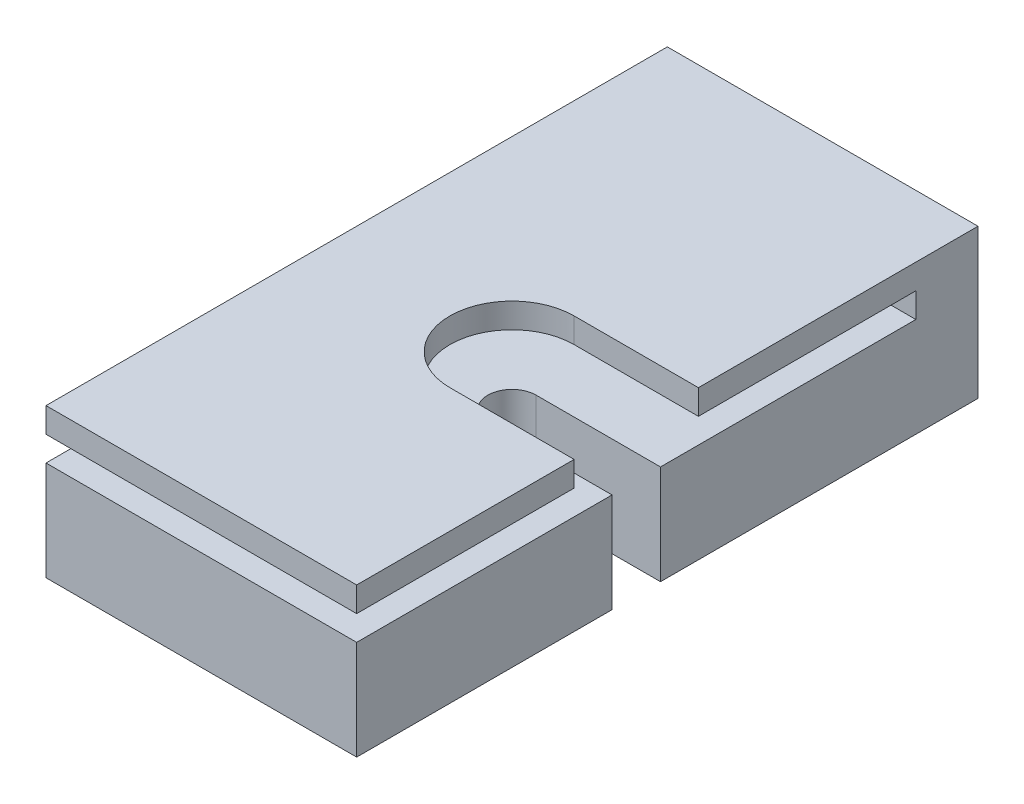
ISO-10303-21;
HEADER;
FILE_DESCRIPTION(('STEP AP214'),'2;1');
FILE_NAME('part.step','',(''),(''),'','','');
FILE_SCHEMA(('AUTOMOTIVE_DESIGN { 1 0 10303 214 1 1 1 1 }'));
ENDSEC;
DATA;
#1=APPLICATION_CONTEXT('core data for automotive mechanical design processes');
#2=APPLICATION_PROTOCOL_DEFINITION('international standard','automotive_design',2000,#1);
#3=PRODUCT_CONTEXT('',#1,'mechanical');
#4=PRODUCT('Part','Part','',(#3));
#5=PRODUCT_RELATED_PRODUCT_CATEGORY('part','',(#4));
#6=PRODUCT_DEFINITION_FORMATION('','',#4);
#7=PRODUCT_DEFINITION_CONTEXT('part definition',#1,'design');
#8=PRODUCT_DEFINITION('design','',#6,#7);
#9=PRODUCT_DEFINITION_SHAPE('','',#8);
#10=(LENGTH_UNIT() NAMED_UNIT(*) SI_UNIT(.MILLI.,.METRE.));
#11=(NAMED_UNIT(*) PLANE_ANGLE_UNIT() SI_UNIT($,.RADIAN.));
#12=(NAMED_UNIT(*) SI_UNIT($,.STERADIAN.) SOLID_ANGLE_UNIT());
#13=UNCERTAINTY_MEASURE_WITH_UNIT(LENGTH_MEASURE(1.E-05),#10,'distance_accuracy_value','');
#14=(GEOMETRIC_REPRESENTATION_CONTEXT(3) GLOBAL_UNCERTAINTY_ASSIGNED_CONTEXT((#13)) GLOBAL_UNIT_ASSIGNED_CONTEXT((#10,
#11,#12)) REPRESENTATION_CONTEXT('',''));
#15=CARTESIAN_POINT('',(0.,0.,0.));
#16=DIRECTION('',(0.,0.,1.));
#17=DIRECTION('',(1.,0.,0.));
#18=AXIS2_PLACEMENT_3D('',#15,#16,#17);
#19=CARTESIAN_POINT('',(-38.284177628754,8.14590879240231,50.));
#20=DIRECTION('',(-1.,0.,0.));
#21=DIRECTION('',(0.,0.,1.));
#22=AXIS2_PLACEMENT_3D('',#19,#20,#21);
#23=PLANE('',#22);
#24=DIRECTION('',(0.,0.,-1.));
#25=VECTOR('',#24,1.);
#26=CARTESIAN_POINT('',(-38.284177628754,-3.85409120759769,50.));
#27=LINE('',#26,#25);
#28=CARTESIAN_POINT('',(-38.284177628754,-3.85409120759769,50.));
#29=VERTEX_POINT('',#28);
#30=CARTESIAN_POINT('',(-38.284177628754,-3.85409120759769,29.45));
#31=VERTEX_POINT('',#30);
#32=EDGE_CURVE('E45',#29,#31,#27,.T.);
#33=ORIENTED_EDGE('',*,*,#32,.T.);
#34=DIRECTION('',(0.,1.,0.));
#35=VECTOR('',#34,1.);
#36=CARTESIAN_POINT('',(-38.284177628754,-16.4243935110429,29.45));
#37=LINE('',#36,#35);
#38=CARTESIAN_POINT('',(-38.284177628754,4.14590879240231,29.45));
#39=VERTEX_POINT('',#38);
#40=EDGE_CURVE('E177',#31,#39,#37,.T.);
#41=ORIENTED_EDGE('',*,*,#40,.T.);
#42=DIRECTION('',(0.,0.,1.));
#43=VECTOR('',#42,1.);
#44=CARTESIAN_POINT('',(-38.284177628754,4.14590879240231,5.));
#45=LINE('',#44,#43);
#46=CARTESIAN_POINT('',(-38.284177628754,4.14590879240231,50.));
#47=VERTEX_POINT('',#46);
#48=EDGE_CURVE('E258',#39,#47,#45,.T.);
#49=ORIENTED_EDGE('',*,*,#48,.T.);
#50=DIRECTION('',(0.,1.,0.));
#51=VECTOR('',#50,1.);
#52=CARTESIAN_POINT('',(-38.284177628754,8.14590879240231,50.));
#53=LINE('',#52,#51);
#54=EDGE_CURVE('E267',#29,#47,#53,.T.);
#55=ORIENTED_EDGE('',*,*,#54,.F.);
#56=EDGE_LOOP('',(#33,#41,#49,#55));
#57=FACE_BOUND('',#56,.T.);
#58=ADVANCED_FACE('F36',(#57),#23,.F.);
#59=DIRECTION('',(0.,-1.,0.));
#60=VECTOR('',#59,1.);
#61=CARTESIAN_POINT('',(-38.284177628754,26.1736651697223,32.5));
#62=LINE('',#61,#60);
#63=CARTESIAN_POINT('',(-38.284177628754,8.14590879240231,32.5));
#64=VERTEX_POINT('',#63);
#65=CARTESIAN_POINT('',(-38.284177628754,6.14590879240231,32.5));
#66=VERTEX_POINT('',#65);
#67=EDGE_CURVE('E206',#64,#66,#62,.T.);
#68=ORIENTED_EDGE('',*,*,#67,.F.);
#69=DIRECTION('',(0.,0.,-1.));
#70=VECTOR('',#69,1.);
#71=CARTESIAN_POINT('',(-38.284177628754,8.14590879240231,50.));
#72=LINE('',#71,#70);
#73=CARTESIAN_POINT('',(-38.284177628754,8.14590879240231,50.));
#74=VERTEX_POINT('',#73);
#75=EDGE_CURVE('E286',#74,#64,#72,.T.);
#76=ORIENTED_EDGE('',*,*,#75,.F.);
#77=CARTESIAN_POINT('',(-38.284177628754,6.14590879240231,50.));
#78=VERTEX_POINT('',#77);
#79=EDGE_CURVE('E266',#78,#74,#53,.T.);
#80=ORIENTED_EDGE('',*,*,#79,.F.);
#81=DIRECTION('',(0.,0.,1.));
#82=VECTOR('',#81,1.);
#83=CARTESIAN_POINT('',(-38.284177628754,6.14590879240231,5.));
#84=LINE('',#83,#82);
#85=EDGE_CURVE('E255',#66,#78,#84,.T.);
#86=ORIENTED_EDGE('',*,*,#85,.F.);
#87=EDGE_LOOP('',(#68,#76,#80,#86));
#88=FACE_BOUND('',#87,.T.);
#89=ADVANCED_FACE('F350',(#88),#23,.F.);
#90=CARTESIAN_POINT('',(-63.284177628754,8.14590879240231,50.));
#91=DIRECTION('',(0.,-1.,0.));
#92=DIRECTION('',(0.,0.,-1.));
#93=AXIS2_PLACEMENT_3D('',#90,#91,#92);
#94=PLANE('',#93);
#95=DIRECTION('',(-1.,0.,0.));
#96=VECTOR('',#95,1.);
#97=CARTESIAN_POINT('',(0.,8.14590879240231,32.5));
#98=LINE('',#97,#96);
#99=CARTESIAN_POINT('',(-48.284177628754,8.14590879240231,32.5));
#100=VERTEX_POINT('',#99);
#101=EDGE_CURVE('E205',#64,#100,#98,.T.);
#102=ORIENTED_EDGE('',*,*,#101,.T.);
#103=CARTESIAN_POINT('',(-48.284177628754,8.14590879240231,27.5));
#104=DIRECTION('',(0.,-1.,0.));
#105=DIRECTION('',(0.,0.,-1.));
#106=AXIS2_PLACEMENT_3D('',#103,#104,#105);
#107=CIRCLE('',#106,5.);
#108=CARTESIAN_POINT('',(-48.284177628754,8.14590879240231,22.5));
#109=VERTEX_POINT('',#108);
#110=EDGE_CURVE('E209',#109,#100,#107,.F.);
#111=ORIENTED_EDGE('',*,*,#110,.F.);
#112=DIRECTION('',(-1.,0.,0.));
#113=VECTOR('',#112,1.);
#114=CARTESIAN_POINT('',(0.,8.14590879240231,22.5));
#115=LINE('',#114,#113);
#116=CARTESIAN_POINT('',(-38.284177628754,8.14590879240231,22.5));
#117=VERTEX_POINT('',#116);
#118=EDGE_CURVE('E203',#117,#109,#115,.T.);
#119=ORIENTED_EDGE('',*,*,#118,.F.);
#120=CARTESIAN_POINT('',(-38.284177628754,8.14590879240231,0.));
#121=VERTEX_POINT('',#120);
#122=EDGE_CURVE('E285',#117,#121,#72,.T.);
#123=ORIENTED_EDGE('',*,*,#122,.T.);
#124=DIRECTION('',(-1.,0.,0.));
#125=VECTOR('',#124,1.);
#126=CARTESIAN_POINT('',(-63.284177628754,8.14590879240231,0.));
#127=LINE('',#126,#125);
#128=CARTESIAN_POINT('',(-63.284177628754,8.14590879240231,0.));
#129=VERTEX_POINT('',#128);
#130=EDGE_CURVE('E281',#121,#129,#127,.T.);
#131=ORIENTED_EDGE('',*,*,#130,.T.);
#132=DIRECTION('',(0.,0.,-1.));
#133=VECTOR('',#132,1.);
#134=CARTESIAN_POINT('',(-63.284177628754,8.14590879240231,50.));
#135=LINE('',#134,#133);
#136=CARTESIAN_POINT('',(-63.284177628754,8.14590879240231,50.));
#137=VERTEX_POINT('',#136);
#138=EDGE_CURVE('E272',#137,#129,#135,.T.);
#139=ORIENTED_EDGE('',*,*,#138,.F.);
#140=DIRECTION('',(-1.,0.,0.));
#141=VECTOR('',#140,1.);
#142=CARTESIAN_POINT('',(-63.284177628754,8.14590879240231,50.));
#143=LINE('',#142,#141);
#144=EDGE_CURVE('E270',#74,#137,#143,.T.);
#145=ORIENTED_EDGE('',*,*,#144,.F.);
#146=ORIENTED_EDGE('',*,*,#75,.T.);
#147=EDGE_LOOP('',(#102,#111,#119,#123,#131,#139,#145,#146));
#148=FACE_BOUND('',#147,.T.);
#149=ADVANCED_FACE('F316',(#148),#94,.F.);
#150=CARTESIAN_POINT('',(-63.284177628754,6.14590879240231,5.));
#151=DIRECTION('',(0.,1.,0.));
#152=DIRECTION('',(0.,0.,1.));
#153=AXIS2_PLACEMENT_3D('',#150,#151,#152);
#154=PLANE('',#153);
#155=DIRECTION('',(1.,0.,0.));
#156=VECTOR('',#155,1.);
#157=CARTESIAN_POINT('',(0.,6.14590879240231,32.5));
#158=LINE('',#157,#156);
#159=CARTESIAN_POINT('',(-48.284177628754,6.14590879240231,32.5));
#160=VERTEX_POINT('',#159);
#161=EDGE_CURVE('E210',#160,#66,#158,.T.);
#162=ORIENTED_EDGE('',*,*,#161,.T.);
#163=ORIENTED_EDGE('',*,*,#85,.T.);
#164=DIRECTION('',(-1.,0.,0.));
#165=VECTOR('',#164,1.);
#166=CARTESIAN_POINT('',(-63.284177628754,6.14590879240231,50.));
#167=LINE('',#166,#165);
#168=CARTESIAN_POINT('',(-63.284177628754,6.14590879240231,50.));
#169=VERTEX_POINT('',#168);
#170=EDGE_CURVE('E236',#78,#169,#167,.T.);
#171=ORIENTED_EDGE('',*,*,#170,.T.);
#172=DIRECTION('',(0.,0.,1.));
#173=VECTOR('',#172,1.);
#174=CARTESIAN_POINT('',(-63.284177628754,6.14590879240231,5.));
#175=LINE('',#174,#173);
#176=CARTESIAN_POINT('',(-63.284177628754,6.14590879240231,5.));
#177=VERTEX_POINT('',#176);
#178=EDGE_CURVE('E248',#177,#169,#175,.T.);
#179=ORIENTED_EDGE('',*,*,#178,.F.);
#180=DIRECTION('',(-1.,0.,0.));
#181=VECTOR('',#180,1.);
#182=CARTESIAN_POINT('',(-63.284177628754,6.14590879240231,5.));
#183=LINE('',#182,#181);
#184=CARTESIAN_POINT('',(-38.284177628754,6.14590879240231,5.));
#185=VERTEX_POINT('',#184);
#186=EDGE_CURVE('E241',#185,#177,#183,.T.);
#187=ORIENTED_EDGE('',*,*,#186,.F.);
#188=CARTESIAN_POINT('',(-38.284177628754,6.14590879240231,22.5));
#189=VERTEX_POINT('',#188);
#190=EDGE_CURVE('E252',#185,#189,#84,.T.);
#191=ORIENTED_EDGE('',*,*,#190,.T.);
#192=DIRECTION('',(1.,0.,0.));
#193=VECTOR('',#192,1.);
#194=CARTESIAN_POINT('',(0.,6.14590879240231,22.5));
#195=LINE('',#194,#193);
#196=CARTESIAN_POINT('',(-48.284177628754,6.14590879240231,22.5));
#197=VERTEX_POINT('',#196);
#198=EDGE_CURVE('E214',#197,#189,#195,.T.);
#199=ORIENTED_EDGE('',*,*,#198,.F.);
#200=CARTESIAN_POINT('',(-48.284177628754,6.14590879240231,27.5));
#201=DIRECTION('',(0.,-1.,0.));
#202=DIRECTION('',(0.,0.,-1.));
#203=AXIS2_PLACEMENT_3D('',#200,#201,#202);
#204=CIRCLE('',#203,5.);
#205=EDGE_CURVE('E61',#160,#197,#204,.T.);
#206=ORIENTED_EDGE('',*,*,#205,.F.);
#207=EDGE_LOOP('',(#162,#163,#171,#179,#187,#191,#199,#206));
#208=FACE_BOUND('',#207,.T.);
#209=ADVANCED_FACE('F338',(#208),#154,.F.);
#210=CARTESIAN_POINT('',(0.,0.,50.));
#211=DIRECTION('',(0.,0.,1.));
#212=DIRECTION('',(1.,0.,0.));
#213=AXIS2_PLACEMENT_3D('',#210,#211,#212);
#214=PLANE('',#213);
#215=ORIENTED_EDGE('',*,*,#170,.F.);
#216=ORIENTED_EDGE('',*,*,#79,.T.);
#217=ORIENTED_EDGE('',*,*,#144,.T.);
#218=DIRECTION('',(0.,-1.,0.));
#219=VECTOR('',#218,1.);
#220=CARTESIAN_POINT('',(-63.284177628754,8.14590879240231,50.));
#221=LINE('',#220,#219);
#222=EDGE_CURVE('E260',#137,#169,#221,.T.);
#223=ORIENTED_EDGE('',*,*,#222,.T.);
#224=EDGE_LOOP('',(#215,#216,#217,#223));
#225=FACE_BOUND('',#224,.T.);
#226=ADVANCED_FACE('F353',(#225),#214,.T.);
#227=CARTESIAN_POINT('',(-63.284177628754,8.14590879240231,50.));
#228=DIRECTION('',(1.,0.,0.));
#229=DIRECTION('',(0.,0.,-1.));
#230=AXIS2_PLACEMENT_3D('',#227,#228,#229);
#231=PLANE('',#230);
#232=DIRECTION('',(0.,-1.,0.));
#233=VECTOR('',#232,1.);
#234=CARTESIAN_POINT('',(-63.284177628754,6.14590879240231,5.));
#235=LINE('',#234,#233);
#236=CARTESIAN_POINT('',(-63.284177628754,4.14590879240231,5.));
#237=VERTEX_POINT('',#236);
#238=EDGE_CURVE('E232',#177,#237,#235,.T.);
#239=ORIENTED_EDGE('',*,*,#238,.F.);
#240=ORIENTED_EDGE('',*,*,#178,.T.);
#241=ORIENTED_EDGE('',*,*,#222,.F.);
#242=ORIENTED_EDGE('',*,*,#138,.T.);
#243=DIRECTION('',(0.,-1.,0.));
#244=VECTOR('',#243,1.);
#245=CARTESIAN_POINT('',(-63.284177628754,8.14590879240231,0.));
#246=LINE('',#245,#244);
#247=CARTESIAN_POINT('',(-63.284177628754,-3.85409120759769,0.));
#248=VERTEX_POINT('',#247);
#249=EDGE_CURVE('E251',#129,#248,#246,.T.);
#250=ORIENTED_EDGE('',*,*,#249,.T.);
#251=DIRECTION('',(0.,0.,-1.));
#252=VECTOR('',#251,1.);
#253=CARTESIAN_POINT('',(-63.284177628754,-3.85409120759769,50.));
#254=LINE('',#253,#252);
#255=CARTESIAN_POINT('',(-63.284177628754,-3.85409120759769,50.));
#256=VERTEX_POINT('',#255);
#257=EDGE_CURVE('E11',#256,#248,#254,.T.);
#258=ORIENTED_EDGE('',*,*,#257,.F.);
#259=CARTESIAN_POINT('',(-63.284177628754,4.14590879240231,50.));
#260=VERTEX_POINT('',#259);
#261=EDGE_CURVE('E264',#260,#256,#221,.T.);
#262=ORIENTED_EDGE('',*,*,#261,.F.);
#263=DIRECTION('',(0.,0.,1.));
#264=VECTOR('',#263,1.);
#265=CARTESIAN_POINT('',(-63.284177628754,4.14590879240231,5.));
#266=LINE('',#265,#264);
#267=EDGE_CURVE('E244',#237,#260,#266,.T.);
#268=ORIENTED_EDGE('',*,*,#267,.F.);
#269=EDGE_LOOP('',(#239,#240,#241,#242,#250,#258,#262,#268));
#270=FACE_BOUND('',#269,.T.);
#271=ADVANCED_FACE('F38',(#270),#231,.F.);
#272=CARTESIAN_POINT('',(-63.284177628754,-3.85409120759769,50.));
#273=DIRECTION('',(0.,1.,0.));
#274=DIRECTION('',(0.,0.,1.));
#275=AXIS2_PLACEMENT_3D('',#272,#273,#274);
#276=PLANE('',#275);
#277=CARTESIAN_POINT('',(-56.284177628754,-3.85409120759769,9.99999999999999));
#278=DIRECTION('',(0.,1.,0.));
#279=DIRECTION('',(0.,0.,1.));
#280=AXIS2_PLACEMENT_3D('',#277,#278,#279);
#281=CIRCLE('',#280,1.5);
#282=CARTESIAN_POINT('',(-56.284177628754,-3.85409120759769,11.5));
#283=VERTEX_POINT('',#282);
#284=EDGE_CURVE('E186',#283,#283,#281,.F.);
#285=ORIENTED_EDGE('',*,*,#284,.F.);
#286=EDGE_LOOP('',(#285));
#287=FACE_BOUND('',#286,.T.);
#288=CARTESIAN_POINT('',(-56.3027558091259,-3.85409120759769,45.));
#289=DIRECTION('',(0.,1.,0.));
#290=DIRECTION('',(0.,0.,1.));
#291=AXIS2_PLACEMENT_3D('',#288,#289,#290);
#292=CIRCLE('',#291,1.5);
#293=CARTESIAN_POINT('',(-56.3027558091259,-3.85409120759769,46.5));
#294=VERTEX_POINT('',#293);
#295=EDGE_CURVE('E187',#294,#294,#292,.F.);
#296=ORIENTED_EDGE('',*,*,#295,.F.);
#297=EDGE_LOOP('',(#296));
#298=FACE_BOUND('',#297,.T.);
#299=CARTESIAN_POINT('',(-50.784177628754,-3.85409120759769,37.));
#300=DIRECTION('',(0.,-1.,0.));
#301=DIRECTION('',(0.,0.,-1.));
#302=AXIS2_PLACEMENT_3D('',#299,#300,#301);
#303=CIRCLE('',#302,1.4224);
#304=CARTESIAN_POINT('',(-50.784177628754,-3.85409120759769,35.5776));
#305=VERTEX_POINT('',#304);
#306=EDGE_CURVE('E225',#305,#305,#303,.T.);
#307=ORIENTED_EDGE('',*,*,#306,.F.);
#308=EDGE_LOOP('',(#307));
#309=FACE_BOUND('',#308,.T.);
#310=CARTESIAN_POINT('',(-48.284177628754,-3.85409120759769,27.5));
#311=DIRECTION('',(0.,1.,0.));
#312=DIRECTION('',(0.,0.,1.));
#313=AXIS2_PLACEMENT_3D('',#310,#311,#312);
#314=CIRCLE('',#313,1.95);
#315=CARTESIAN_POINT('',(-48.284177628754,-3.85409120759769,25.55));
#316=VERTEX_POINT('',#315);
#317=CARTESIAN_POINT('',(-48.284177628754,-3.85409120759769,29.45));
#318=VERTEX_POINT('',#317);
#319=EDGE_CURVE('E160',#316,#318,#314,.T.);
#320=ORIENTED_EDGE('',*,*,#319,.T.);
#321=DIRECTION('',(-1.,0.,0.));
#322=VECTOR('',#321,1.);
#323=CARTESIAN_POINT('',(-63.284177628754,-3.85409120759769,29.45));
#324=LINE('',#323,#322);
#325=EDGE_CURVE('E182',#31,#318,#324,.T.);
#326=ORIENTED_EDGE('',*,*,#325,.F.);
#327=ORIENTED_EDGE('',*,*,#32,.F.);
#328=DIRECTION('',(1.,0.,0.));
#329=VECTOR('',#328,1.);
#330=CARTESIAN_POINT('',(-63.284177628754,-3.85409120759769,50.));
#331=LINE('',#330,#329);
#332=EDGE_CURVE('E263',#256,#29,#331,.T.);
#333=ORIENTED_EDGE('',*,*,#332,.F.);
#334=ORIENTED_EDGE('',*,*,#257,.T.);
#335=DIRECTION('',(1.,0.,0.));
#336=VECTOR('',#335,1.);
#337=CARTESIAN_POINT('',(-63.284177628754,-3.85409120759769,0.));
#338=LINE('',#337,#336);
#339=CARTESIAN_POINT('',(-38.284177628754,-3.85409120759769,0.));
#340=VERTEX_POINT('',#339);
#341=EDGE_CURVE('E275',#248,#340,#338,.T.);
#342=ORIENTED_EDGE('',*,*,#341,.T.);
#343=CARTESIAN_POINT('',(-38.284177628754,-3.85409120759769,25.55));
#344=VERTEX_POINT('',#343);
#345=EDGE_CURVE('E289',#344,#340,#27,.T.);
#346=ORIENTED_EDGE('',*,*,#345,.F.);
#347=DIRECTION('',(1.,0.,0.));
#348=VECTOR('',#347,1.);
#349=CARTESIAN_POINT('',(-63.284177628754,-3.85409120759769,25.55));
#350=LINE('',#349,#348);
#351=EDGE_CURVE('E194',#316,#344,#350,.T.);
#352=ORIENTED_EDGE('',*,*,#351,.F.);
#353=EDGE_LOOP('',(#320,#326,#327,#333,#334,#342,#346,#352));
#354=FACE_BOUND('',#353,.T.);
#355=ADVANCED_FACE('F324',(#287,#298,#309,#354),#276,.F.);
#356=CARTESIAN_POINT('',(-38.284177628754,4.14590879240231,5.));
#357=VERTEX_POINT('',#356);
#358=CARTESIAN_POINT('',(-38.284177628754,4.14590879240231,25.55));
#359=VERTEX_POINT('',#358);
#360=EDGE_CURVE('E256',#357,#359,#45,.T.);
#361=ORIENTED_EDGE('',*,*,#360,.T.);
#362=DIRECTION('',(0.,1.,0.));
#363=VECTOR('',#362,1.);
#364=CARTESIAN_POINT('',(-38.284177628754,-16.4243935110429,25.55));
#365=LINE('',#364,#363);
#366=EDGE_CURVE('E53',#344,#359,#365,.T.);
#367=ORIENTED_EDGE('',*,*,#366,.F.);
#368=ORIENTED_EDGE('',*,*,#345,.T.);
#369=DIRECTION('',(0.,1.,0.));
#370=VECTOR('',#369,1.);
#371=CARTESIAN_POINT('',(-38.284177628754,8.14590879240231,0.));
#372=LINE('',#371,#370);
#373=EDGE_CURVE('E278',#340,#121,#372,.T.);
#374=ORIENTED_EDGE('',*,*,#373,.T.);
#375=ORIENTED_EDGE('',*,*,#122,.F.);
#376=DIRECTION('',(0.,-1.,0.));
#377=VECTOR('',#376,1.);
#378=CARTESIAN_POINT('',(-38.284177628754,26.1736651697223,22.5));
#379=LINE('',#378,#377);
#380=EDGE_CURVE('E218',#117,#189,#379,.T.);
#381=ORIENTED_EDGE('',*,*,#380,.T.);
#382=ORIENTED_EDGE('',*,*,#190,.F.);
#383=DIRECTION('',(0.,1.,0.));
#384=VECTOR('',#383,1.);
#385=CARTESIAN_POINT('',(-38.284177628754,6.14590879240231,5.));
#386=LINE('',#385,#384);
#387=EDGE_CURVE('E239',#357,#185,#386,.T.);
#388=ORIENTED_EDGE('',*,*,#387,.F.);
#389=EDGE_LOOP('',(#361,#367,#368,#374,#375,#381,#382,#388));
#390=FACE_BOUND('',#389,.T.);
#391=ADVANCED_FACE('F321',(#390),#23,.F.);
#392=DIRECTION('',(1.,0.,0.));
#393=VECTOR('',#392,1.);
#394=CARTESIAN_POINT('',(-63.284177628754,4.14590879240231,50.));
#395=LINE('',#394,#393);
#396=EDGE_CURVE('E231',#260,#47,#395,.T.);
#397=ORIENTED_EDGE('',*,*,#396,.F.);
#398=ORIENTED_EDGE('',*,*,#261,.T.);
#399=ORIENTED_EDGE('',*,*,#332,.T.);
#400=ORIENTED_EDGE('',*,*,#54,.T.);
#401=EDGE_LOOP('',(#397,#398,#399,#400));
#402=FACE_BOUND('',#401,.T.);
#403=ADVANCED_FACE('F302',(#402),#214,.T.);
#404=CARTESIAN_POINT('',(0.,0.,0.));
#405=DIRECTION('',(0.,0.,1.));
#406=DIRECTION('',(1.,0.,0.));
#407=AXIS2_PLACEMENT_3D('',#404,#405,#406);
#408=PLANE('',#407);
#409=CARTESIAN_POINT('',(-59.284177628754,0.,0.));
#410=DIRECTION('',(0.,0.,1.));
#411=DIRECTION('',(1.,0.,0.));
#412=AXIS2_PLACEMENT_3D('',#409,#410,#411);
#413=CIRCLE('',#412,1.42239999999999);
#414=CARTESIAN_POINT('',(-57.861777628754,0.,0.));
#415=VERTEX_POINT('',#414);
#416=EDGE_CURVE('E40',#415,#415,#413,.F.);
#417=ORIENTED_EDGE('',*,*,#416,.F.);
#418=EDGE_LOOP('',(#417));
#419=FACE_BOUND('',#418,.T.);
#420=CARTESIAN_POINT('',(-42.284177628754,0.,0.));
#421=DIRECTION('',(0.,0.,1.));
#422=DIRECTION('',(1.,0.,0.));
#423=AXIS2_PLACEMENT_3D('',#420,#421,#422);
#424=CIRCLE('',#423,1.42239999999999);
#425=CARTESIAN_POINT('',(-40.861777628754,0.,0.));
#426=VERTEX_POINT('',#425);
#427=EDGE_CURVE('E200',#426,#426,#424,.F.);
#428=ORIENTED_EDGE('',*,*,#427,.F.);
#429=EDGE_LOOP('',(#428));
#430=FACE_BOUND('',#429,.T.);
#431=ORIENTED_EDGE('',*,*,#249,.F.);
#432=ORIENTED_EDGE('',*,*,#130,.F.);
#433=ORIENTED_EDGE('',*,*,#373,.F.);
#434=ORIENTED_EDGE('',*,*,#341,.F.);
#435=EDGE_LOOP('',(#431,#432,#433,#434));
#436=FACE_BOUND('',#435,.T.);
#437=ADVANCED_FACE('F299',(#419,#430,#436),#408,.F.);
#438=CARTESIAN_POINT('',(-63.284177628754,4.14590879240231,5.));
#439=DIRECTION('',(0.,-1.,0.));
#440=DIRECTION('',(0.,0.,-1.));
#441=AXIS2_PLACEMENT_3D('',#438,#439,#440);
#442=PLANE('',#441);
#443=CARTESIAN_POINT('',(-50.784177628754,4.14590879240231,37.));
#444=DIRECTION('',(0.,-1.,0.));
#445=DIRECTION('',(0.,0.,-1.));
#446=AXIS2_PLACEMENT_3D('',#443,#444,#445);
#447=CIRCLE('',#446,1.4224);
#448=CARTESIAN_POINT('',(-50.784177628754,4.14590879240231,35.5776));
#449=VERTEX_POINT('',#448);
#450=EDGE_CURVE('E228',#449,#449,#447,.F.);
#451=ORIENTED_EDGE('',*,*,#450,.F.);
#452=EDGE_LOOP('',(#451));
#453=FACE_BOUND('',#452,.T.);
#454=ORIENTED_EDGE('',*,*,#48,.F.);
#455=DIRECTION('',(1.,0.,0.));
#456=VECTOR('',#455,1.);
#457=CARTESIAN_POINT('',(-63.284177628754,4.14590879240231,29.45));
#458=LINE('',#457,#456);
#459=CARTESIAN_POINT('',(-48.284177628754,4.14590879240231,29.45));
#460=VERTEX_POINT('',#459);
#461=EDGE_CURVE('E163',#460,#39,#458,.T.);
#462=ORIENTED_EDGE('',*,*,#461,.F.);
#463=CARTESIAN_POINT('',(-48.284177628754,4.14590879240231,27.5));
#464=DIRECTION('',(0.,-1.,0.));
#465=DIRECTION('',(0.,0.,-1.));
#466=AXIS2_PLACEMENT_3D('',#463,#464,#465);
#467=CIRCLE('',#466,1.95);
#468=CARTESIAN_POINT('',(-48.284177628754,4.14590879240231,25.55));
#469=VERTEX_POINT('',#468);
#470=EDGE_CURVE('E157',#460,#469,#467,.T.);
#471=ORIENTED_EDGE('',*,*,#470,.T.);
#472=DIRECTION('',(-1.,0.,0.));
#473=VECTOR('',#472,1.);
#474=CARTESIAN_POINT('',(-63.284177628754,4.14590879240231,25.55));
#475=LINE('',#474,#473);
#476=EDGE_CURVE('E165',#359,#469,#475,.T.);
#477=ORIENTED_EDGE('',*,*,#476,.F.);
#478=ORIENTED_EDGE('',*,*,#360,.F.);
#479=DIRECTION('',(1.,0.,0.));
#480=VECTOR('',#479,1.);
#481=CARTESIAN_POINT('',(-63.284177628754,4.14590879240231,5.));
#482=LINE('',#481,#480);
#483=EDGE_CURVE('E235',#237,#357,#482,.T.);
#484=ORIENTED_EDGE('',*,*,#483,.F.);
#485=ORIENTED_EDGE('',*,*,#267,.T.);
#486=ORIENTED_EDGE('',*,*,#396,.T.);
#487=EDGE_LOOP('',(#454,#462,#471,#477,#478,#484,#485,#486));
#488=FACE_BOUND('',#487,.T.);
#489=ADVANCED_FACE('F171',(#453,#488),#442,.F.);
#490=CARTESIAN_POINT('',(0.,0.,5.));
#491=DIRECTION('',(0.,0.,1.));
#492=DIRECTION('',(1.,0.,0.));
#493=AXIS2_PLACEMENT_3D('',#490,#491,#492);
#494=PLANE('',#493);
#495=ORIENTED_EDGE('',*,*,#238,.T.);
#496=ORIENTED_EDGE('',*,*,#483,.T.);
#497=ORIENTED_EDGE('',*,*,#387,.T.);
#498=ORIENTED_EDGE('',*,*,#186,.T.);
#499=EDGE_LOOP('',(#495,#496,#497,#498));
#500=FACE_BOUND('',#499,.T.);
#501=ADVANCED_FACE('F334',(#500),#494,.T.);
#502=CARTESIAN_POINT('',(-50.784177628754,8.16906353464128,37.));
#503=DIRECTION('',(0.,-1.,0.));
#504=DIRECTION('',(0.,0.,-1.));
#505=AXIS2_PLACEMENT_3D('',#502,#503,#504);
#506=CYLINDRICAL_SURFACE('',#505,1.4224);
#507=ORIENTED_EDGE('',*,*,#450,.T.);
#508=EDGE_LOOP('',(#507));
#509=FACE_BOUND('',#508,.T.);
#510=ORIENTED_EDGE('',*,*,#306,.T.);
#511=EDGE_LOOP('',(#510));
#512=FACE_BOUND('',#511,.T.);
#513=ADVANCED_FACE('F383',(#509,#512),#506,.F.);
#514=CARTESIAN_POINT('',(-48.284177628754,26.1736651697223,27.5));
#515=DIRECTION('',(0.,-1.,0.));
#516=DIRECTION('',(0.,0.,-1.));
#517=AXIS2_PLACEMENT_3D('',#514,#515,#516);
#518=CYLINDRICAL_SURFACE('',#517,5.);
#519=ORIENTED_EDGE('',*,*,#110,.T.);
#520=DIRECTION('',(0.,-1.,0.));
#521=VECTOR('',#520,1.);
#522=CARTESIAN_POINT('',(-48.284177628754,26.1736651697223,32.5));
#523=LINE('',#522,#521);
#524=EDGE_CURVE('E216',#100,#160,#523,.T.);
#525=ORIENTED_EDGE('',*,*,#524,.T.);
#526=ORIENTED_EDGE('',*,*,#205,.T.);
#527=DIRECTION('',(0.,-1.,0.));
#528=VECTOR('',#527,1.);
#529=CARTESIAN_POINT('',(-48.284177628754,26.1736651697223,22.5));
#530=LINE('',#529,#528);
#531=EDGE_CURVE('E221',#109,#197,#530,.T.);
#532=ORIENTED_EDGE('',*,*,#531,.F.);
#533=EDGE_LOOP('',(#519,#525,#526,#532));
#534=FACE_BOUND('',#533,.T.);
#535=ADVANCED_FACE('F385',(#534),#518,.F.);
#536=CARTESIAN_POINT('',(0.,26.1736651697223,32.5));
#537=DIRECTION('',(0.,0.,-1.));
#538=DIRECTION('',(-1.,0.,0.));
#539=AXIS2_PLACEMENT_3D('',#536,#537,#538);
#540=PLANE('',#539);
#541=ORIENTED_EDGE('',*,*,#67,.T.);
#542=ORIENTED_EDGE('',*,*,#161,.F.);
#543=ORIENTED_EDGE('',*,*,#524,.F.);
#544=ORIENTED_EDGE('',*,*,#101,.F.);
#545=EDGE_LOOP('',(#541,#542,#543,#544));
#546=FACE_BOUND('',#545,.T.);
#547=ADVANCED_FACE('F392',(#546),#540,.T.);
#548=CARTESIAN_POINT('',(0.,26.1736651697223,22.5));
#549=DIRECTION('',(0.,0.,-1.));
#550=DIRECTION('',(-1.,0.,0.));
#551=AXIS2_PLACEMENT_3D('',#548,#549,#550);
#552=PLANE('',#551);
#553=ORIENTED_EDGE('',*,*,#118,.T.);
#554=ORIENTED_EDGE('',*,*,#531,.T.);
#555=ORIENTED_EDGE('',*,*,#198,.T.);
#556=ORIENTED_EDGE('',*,*,#380,.F.);
#557=EDGE_LOOP('',(#553,#554,#555,#556));
#558=FACE_BOUND('',#557,.T.);
#559=ADVANCED_FACE('F341',(#558),#552,.F.);
#560=CARTESIAN_POINT('',(-42.284177628754,0.,5.));
#561=DIRECTION('',(0.,0.,-1.));
#562=DIRECTION('',(-1.,0.,0.));
#563=AXIS2_PLACEMENT_3D('',#560,#561,#562);
#564=CYLINDRICAL_SURFACE('',#563,1.42239999999999);
#565=CARTESIAN_POINT('',(-42.284177628754,0.,5.));
#566=DIRECTION('',(0.,0.,1.));
#567=DIRECTION('',(1.,0.,0.));
#568=AXIS2_PLACEMENT_3D('',#565,#566,#567);
#569=CIRCLE('',#568,1.42239999999999);
#570=CARTESIAN_POINT('',(-40.861777628754,0.,5.));
#571=VERTEX_POINT('',#570);
#572=EDGE_CURVE('E190',#571,#571,#569,.T.);
#573=ORIENTED_EDGE('',*,*,#572,.T.);
#574=EDGE_LOOP('',(#573));
#575=FACE_BOUND('',#574,.T.);
#576=ORIENTED_EDGE('',*,*,#427,.T.);
#577=EDGE_LOOP('',(#576));
#578=FACE_BOUND('',#577,.T.);
#579=ADVANCED_FACE('F445',(#575,#578),#564,.F.);
#580=CARTESIAN_POINT('',(-42.284177628754,0.,5.));
#581=DIRECTION('',(0.,0.,1.));
#582=DIRECTION('',(1.,0.,0.));
#583=AXIS2_PLACEMENT_3D('',#580,#581,#582);
#584=PLANE('',#583);
#585=ORIENTED_EDGE('',*,*,#572,.F.);
#586=EDGE_LOOP('',(#585));
#587=FACE_BOUND('',#586,.T.);
#588=ADVANCED_FACE('F458',(#587),#584,.F.);
#589=CARTESIAN_POINT('',(-59.284177628754,0.,5.));
#590=DIRECTION('',(0.,0.,-1.));
#591=DIRECTION('',(-1.,0.,0.));
#592=AXIS2_PLACEMENT_3D('',#589,#590,#591);
#593=CYLINDRICAL_SURFACE('',#592,1.42239999999999);
#594=CARTESIAN_POINT('',(-59.284177628754,0.,5.));
#595=DIRECTION('',(0.,0.,1.));
#596=DIRECTION('',(1.,0.,0.));
#597=AXIS2_PLACEMENT_3D('',#594,#595,#596);
#598=CIRCLE('',#597,1.42239999999999);
#599=CARTESIAN_POINT('',(-57.861777628754,0.,5.));
#600=VERTEX_POINT('',#599);
#601=EDGE_CURVE('E197',#600,#600,#598,.T.);
#602=ORIENTED_EDGE('',*,*,#601,.T.);
#603=EDGE_LOOP('',(#602));
#604=FACE_BOUND('',#603,.T.);
#605=ORIENTED_EDGE('',*,*,#416,.T.);
#606=EDGE_LOOP('',(#605));
#607=FACE_BOUND('',#606,.T.);
#608=ADVANCED_FACE('F297',(#604,#607),#593,.F.);
#609=CARTESIAN_POINT('',(-59.284177628754,0.,5.));
#610=DIRECTION('',(0.,0.,1.));
#611=DIRECTION('',(1.,0.,0.));
#612=AXIS2_PLACEMENT_3D('',#609,#610,#611);
#613=PLANE('',#612);
#614=ORIENTED_EDGE('',*,*,#601,.F.);
#615=EDGE_LOOP('',(#614));
#616=FACE_BOUND('',#615,.T.);
#617=ADVANCED_FACE('F479',(#616),#613,.F.);
#618=CARTESIAN_POINT('',(-56.3027558091259,-8.09673189471699,45.));
#619=DIRECTION('',(0.,1.,0.));
#620=DIRECTION('',(0.,0.,1.));
#621=AXIS2_PLACEMENT_3D('',#618,#619,#620);
#622=CYLINDRICAL_SURFACE('',#621,1.5);
#623=ORIENTED_EDGE('',*,*,#295,.T.);
#624=EDGE_LOOP('',(#623));
#625=FACE_BOUND('',#624,.T.);
#626=CARTESIAN_POINT('',(-56.3027558091259,1.14590879240231,45.));
#627=DIRECTION('',(0.,1.,0.));
#628=DIRECTION('',(0.,0.,1.));
#629=AXIS2_PLACEMENT_3D('',#626,#627,#628);
#630=CIRCLE('',#629,1.5);
#631=CARTESIAN_POINT('',(-56.3027558091259,1.14590879240231,46.5));
#632=VERTEX_POINT('',#631);
#633=EDGE_CURVE('E191',#632,#632,#630,.T.);
#634=ORIENTED_EDGE('',*,*,#633,.T.);
#635=EDGE_LOOP('',(#634));
#636=FACE_BOUND('',#635,.T.);
#637=ADVANCED_FACE('F490',(#625,#636),#622,.F.);
#638=CARTESIAN_POINT('',(-56.3027558091259,1.14590879240231,45.));
#639=DIRECTION('',(0.,1.,0.));
#640=DIRECTION('',(0.,0.,1.));
#641=AXIS2_PLACEMENT_3D('',#638,#639,#640);
#642=PLANE('',#641);
#643=ORIENTED_EDGE('',*,*,#633,.F.);
#644=EDGE_LOOP('',(#643));
#645=FACE_BOUND('',#644,.T.);
#646=ADVANCED_FACE('F501',(#645),#642,.F.);
#647=CARTESIAN_POINT('',(-56.284177628754,-8.09673189471699,9.99999999999999));
#648=DIRECTION('',(0.,1.,0.));
#649=DIRECTION('',(0.,0.,1.));
#650=AXIS2_PLACEMENT_3D('',#647,#648,#649);
#651=CYLINDRICAL_SURFACE('',#650,1.5);
#652=ORIENTED_EDGE('',*,*,#284,.T.);
#653=EDGE_LOOP('',(#652));
#654=FACE_BOUND('',#653,.T.);
#655=CARTESIAN_POINT('',(-56.284177628754,1.14590879240231,9.99999999999999));
#656=DIRECTION('',(0.,1.,0.));
#657=DIRECTION('',(0.,0.,1.));
#658=AXIS2_PLACEMENT_3D('',#655,#656,#657);
#659=CIRCLE('',#658,1.5);
#660=CARTESIAN_POINT('',(-56.284177628754,1.14590879240231,11.5));
#661=VERTEX_POINT('',#660);
#662=EDGE_CURVE('E183',#661,#661,#659,.T.);
#663=ORIENTED_EDGE('',*,*,#662,.T.);
#664=EDGE_LOOP('',(#663));
#665=FACE_BOUND('',#664,.T.);
#666=ADVANCED_FACE('F512',(#654,#665),#651,.F.);
#667=CARTESIAN_POINT('',(-56.284177628754,1.14590879240231,9.99999999999999));
#668=DIRECTION('',(0.,1.,0.));
#669=DIRECTION('',(0.,0.,1.));
#670=AXIS2_PLACEMENT_3D('',#667,#668,#669);
#671=PLANE('',#670);
#672=ORIENTED_EDGE('',*,*,#662,.F.);
#673=EDGE_LOOP('',(#672));
#674=FACE_BOUND('',#673,.T.);
#675=ADVANCED_FACE('F523',(#674),#671,.F.);
#676=CARTESIAN_POINT('',(-48.284177628754,-16.4243935110429,27.5));
#677=DIRECTION('',(0.,1.,0.));
#678=DIRECTION('',(0.,0.,1.));
#679=AXIS2_PLACEMENT_3D('',#676,#677,#678);
#680=CYLINDRICAL_SURFACE('',#679,1.95);
#681=DIRECTION('',(0.,1.,0.));
#682=VECTOR('',#681,1.);
#683=CARTESIAN_POINT('',(-48.284177628754,-16.4243935110429,25.55));
#684=LINE('',#683,#682);
#685=EDGE_CURVE('E153',#316,#469,#684,.T.);
#686=ORIENTED_EDGE('',*,*,#685,.T.);
#687=ORIENTED_EDGE('',*,*,#470,.F.);
#688=DIRECTION('',(0.,1.,0.));
#689=VECTOR('',#688,1.);
#690=CARTESIAN_POINT('',(-48.284177628754,-16.4243935110429,29.45));
#691=LINE('',#690,#689);
#692=EDGE_CURVE('E162',#318,#460,#691,.T.);
#693=ORIENTED_EDGE('',*,*,#692,.F.);
#694=ORIENTED_EDGE('',*,*,#319,.F.);
#695=EDGE_LOOP('',(#686,#687,#693,#694));
#696=FACE_BOUND('',#695,.T.);
#697=ADVANCED_FACE('F154',(#696),#680,.F.);
#698=CARTESIAN_POINT('',(-63.284177628754,-16.4243935110429,29.45));
#699=DIRECTION('',(0.,0.,1.));
#700=DIRECTION('',(1.,0.,0.));
#701=AXIS2_PLACEMENT_3D('',#698,#699,#700);
#702=PLANE('',#701);
#703=ORIENTED_EDGE('',*,*,#325,.T.);
#704=ORIENTED_EDGE('',*,*,#692,.T.);
#705=ORIENTED_EDGE('',*,*,#461,.T.);
#706=ORIENTED_EDGE('',*,*,#40,.F.);
#707=EDGE_LOOP('',(#703,#704,#705,#706));
#708=FACE_BOUND('',#707,.T.);
#709=ADVANCED_FACE('F544',(#708),#702,.F.);
#710=CARTESIAN_POINT('',(-63.284177628754,-16.4243935110429,25.55));
#711=DIRECTION('',(0.,0.,-1.));
#712=DIRECTION('',(-1.,0.,0.));
#713=AXIS2_PLACEMENT_3D('',#710,#711,#712);
#714=PLANE('',#713);
#715=ORIENTED_EDGE('',*,*,#351,.T.);
#716=ORIENTED_EDGE('',*,*,#366,.T.);
#717=ORIENTED_EDGE('',*,*,#476,.T.);
#718=ORIENTED_EDGE('',*,*,#685,.F.);
#719=EDGE_LOOP('',(#715,#716,#717,#718));
#720=FACE_BOUND('',#719,.T.);
#721=ADVANCED_FACE('F166',(#720),#714,.F.);
#722=CLOSED_SHELL('',(#58,#89,#149,#209,#226,#271,#355,#391,#403,#437,#489,#501,#513,#535,#547,
#559,#579,#588,#608,#617,#637,#646,#666,#675,#697,#709,#721));
#723=MANIFOLD_SOLID_BREP('B2',#722);
#724=ADVANCED_BREP_SHAPE_REPRESENTATION('',(#18,#723),#14);
#725=SHAPE_DEFINITION_REPRESENTATION(#9,#724);
ENDSEC;
END-ISO-10303-21;
